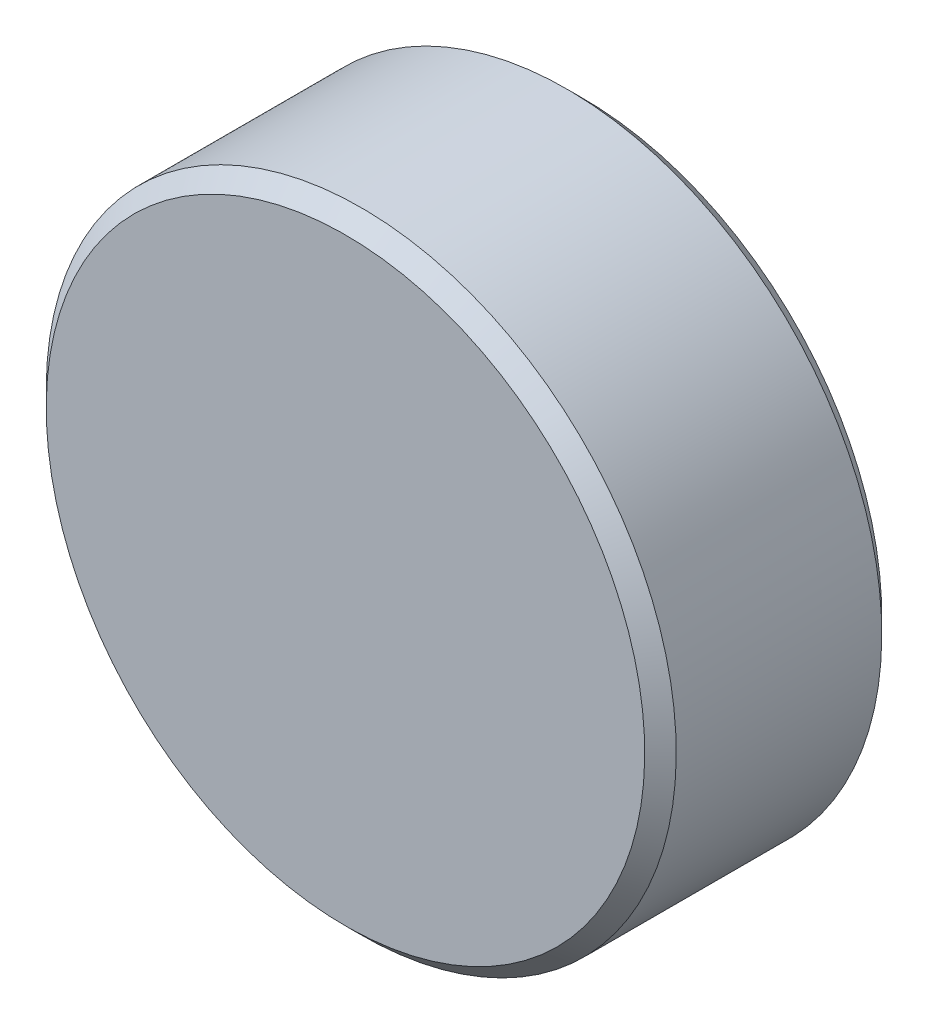
ISO-10303-21;
HEADER;
FILE_DESCRIPTION(('STEP AP214'),'2;1');
FILE_NAME('part.step','',(''),(''),'','','');
FILE_SCHEMA(('AUTOMOTIVE_DESIGN { 1 0 10303 214 1 1 1 1 }'));
ENDSEC;
DATA;
#1=APPLICATION_CONTEXT('core data for automotive mechanical design processes');
#2=APPLICATION_PROTOCOL_DEFINITION('international standard','automotive_design',2000,#1);
#3=PRODUCT_CONTEXT('',#1,'mechanical');
#4=PRODUCT('Part','Part','',(#3));
#5=PRODUCT_RELATED_PRODUCT_CATEGORY('part','',(#4));
#6=PRODUCT_DEFINITION_FORMATION('','',#4);
#7=PRODUCT_DEFINITION_CONTEXT('part definition',#1,'design');
#8=PRODUCT_DEFINITION('design','',#6,#7);
#9=PRODUCT_DEFINITION_SHAPE('','',#8);
#10=(LENGTH_UNIT() NAMED_UNIT(*) SI_UNIT(.MILLI.,.METRE.));
#11=(NAMED_UNIT(*) PLANE_ANGLE_UNIT() SI_UNIT($,.RADIAN.));
#12=(NAMED_UNIT(*) SI_UNIT($,.STERADIAN.) SOLID_ANGLE_UNIT());
#13=UNCERTAINTY_MEASURE_WITH_UNIT(LENGTH_MEASURE(1.E-05),#10,'distance_accuracy_value','');
#14=(GEOMETRIC_REPRESENTATION_CONTEXT(3) GLOBAL_UNCERTAINTY_ASSIGNED_CONTEXT((#13)) GLOBAL_UNIT_ASSIGNED_CONTEXT((#10,
#11,#12)) REPRESENTATION_CONTEXT('',''));
#15=CARTESIAN_POINT('',(0.,0.,0.));
#16=DIRECTION('',(0.,0.,1.));
#17=DIRECTION('',(1.,0.,0.));
#18=AXIS2_PLACEMENT_3D('',#15,#16,#17);
#19=CARTESIAN_POINT('',(0.,0.,186.525));
#20=DIRECTION('',(0.,0.,-1.));
#21=DIRECTION('',(-0.188302244036741,0.982111126548685,0.));
#22=AXIS2_PLACEMENT_3D('',#19,#20,#21);
#23=PLANE('',#22);
#24=CARTESIAN_POINT('',(0.,0.,186.525));
#25=DIRECTION('',(0.,0.,1.));
#26=DIRECTION('',(-0.982111126548685,-0.188302244036741,0.));
#27=AXIS2_PLACEMENT_3D('',#24,#25,#26);
#28=CIRCLE('',#27,38.);
#29=CARTESIAN_POINT('',(-37.32022280885,-7.15548527339613,186.525));
#30=VERTEX_POINT('',#29);
#31=EDGE_CURVE('E55',#30,#30,#28,.T.);
#32=ORIENTED_EDGE('',*,*,#31,.T.);
#33=EDGE_LOOP('',(#32));
#34=FACE_BOUND('',#33,.T.);
#35=ADVANCED_FACE('F17',(#34),#23,.F.);
#36=CARTESIAN_POINT('',(0.,0.,156.425));
#37=DIRECTION('',(0.,0.,-1.));
#38=DIRECTION('',(-0.188302244036741,0.982111126548685,0.));
#39=AXIS2_PLACEMENT_3D('',#36,#37,#38);
#40=PLANE('',#39);
#41=CARTESIAN_POINT('',(0.,0.,156.425));
#42=DIRECTION('',(0.,0.,-1.));
#43=DIRECTION('',(-0.982111126548685,-0.188302244036741,0.));
#44=AXIS2_PLACEMENT_3D('',#41,#42,#43);
#45=CIRCLE('',#44,38.);
#46=CARTESIAN_POINT('',(37.32022280885,7.15548527339614,156.425));
#47=VERTEX_POINT('',#46);
#48=EDGE_CURVE('E27',#47,#47,#45,.T.);
#49=ORIENTED_EDGE('',*,*,#48,.T.);
#50=EDGE_LOOP('',(#49));
#51=FACE_BOUND('',#50,.T.);
#52=ADVANCED_FACE('F68',(#51),#40,.T.);
#53=CARTESIAN_POINT('',(0.,0.,156.425));
#54=DIRECTION('',(0.,0.,1.));
#55=DIRECTION('',(0.982111126548685,0.188302244036741,0.));
#56=AXIS2_PLACEMENT_3D('',#53,#54,#55);
#57=CYLINDRICAL_SURFACE('',#56,40.);
#58=CARTESIAN_POINT('',(0.,0.,184.525));
#59=DIRECTION('',(0.,0.,-1.));
#60=DIRECTION('',(-0.982111126548685,-0.188302244036741,0.));
#61=AXIS2_PLACEMENT_3D('',#58,#59,#60);
#62=CIRCLE('',#61,40.);
#63=CARTESIAN_POINT('',(-39.2844450619474,-7.53208976146961,184.525));
#64=VERTEX_POINT('',#63);
#65=EDGE_CURVE('E47',#64,#64,#62,.T.);
#66=ORIENTED_EDGE('',*,*,#65,.T.);
#67=EDGE_LOOP('',(#66));
#68=FACE_BOUND('',#67,.T.);
#69=CARTESIAN_POINT('',(0.,0.,158.425));
#70=DIRECTION('',(0.,0.,1.));
#71=DIRECTION('',(-0.982111126548685,-0.188302244036741,0.));
#72=AXIS2_PLACEMENT_3D('',#69,#70,#71);
#73=CIRCLE('',#72,40.);
#74=CARTESIAN_POINT('',(39.2844450619474,7.53208976146962,158.425));
#75=VERTEX_POINT('',#74);
#76=EDGE_CURVE('E11',#75,#75,#73,.T.);
#77=ORIENTED_EDGE('',*,*,#76,.T.);
#78=EDGE_LOOP('',(#77));
#79=FACE_BOUND('',#78,.T.);
#80=ADVANCED_FACE('F72',(#68,#79),#57,.T.);
#81=CARTESIAN_POINT('',(0.,0.,156.425));
#82=DIRECTION('',(0.,0.,1.));
#83=DIRECTION('',(0.982111126548685,0.188302244036741,0.));
#84=AXIS2_PLACEMENT_3D('',#81,#82,#83);
#85=CONICAL_SURFACE('',#84,38.,0.785398163397448);
#86=ORIENTED_EDGE('',*,*,#76,.F.);
#87=EDGE_LOOP('',(#86));
#88=FACE_BOUND('',#87,.T.);
#89=ORIENTED_EDGE('',*,*,#48,.F.);
#90=EDGE_LOOP('',(#89));
#91=FACE_BOUND('',#90,.T.);
#92=ADVANCED_FACE('F19',(#88,#91),#85,.T.);
#93=CARTESIAN_POINT('',(0.,0.,184.525));
#94=DIRECTION('',(0.,0.,-1.));
#95=DIRECTION('',(-0.982111126548685,-0.188302244036741,0.));
#96=AXIS2_PLACEMENT_3D('',#93,#94,#95);
#97=CONICAL_SURFACE('',#96,40.,0.785398163397448);
#98=ORIENTED_EDGE('',*,*,#65,.F.);
#99=EDGE_LOOP('',(#98));
#100=FACE_BOUND('',#99,.T.);
#101=ORIENTED_EDGE('',*,*,#31,.F.);
#102=EDGE_LOOP('',(#101));
#103=FACE_BOUND('',#102,.T.);
#104=ADVANCED_FACE('F71',(#100,#103),#97,.T.);
#105=CLOSED_SHELL('',(#35,#52,#80,#92,#104));
#106=MANIFOLD_SOLID_BREP('B1',#105);
#107=ADVANCED_BREP_SHAPE_REPRESENTATION('',(#18,#106),#14);
#108=SHAPE_DEFINITION_REPRESENTATION(#9,#107);
ENDSEC;
END-ISO-10303-21;
